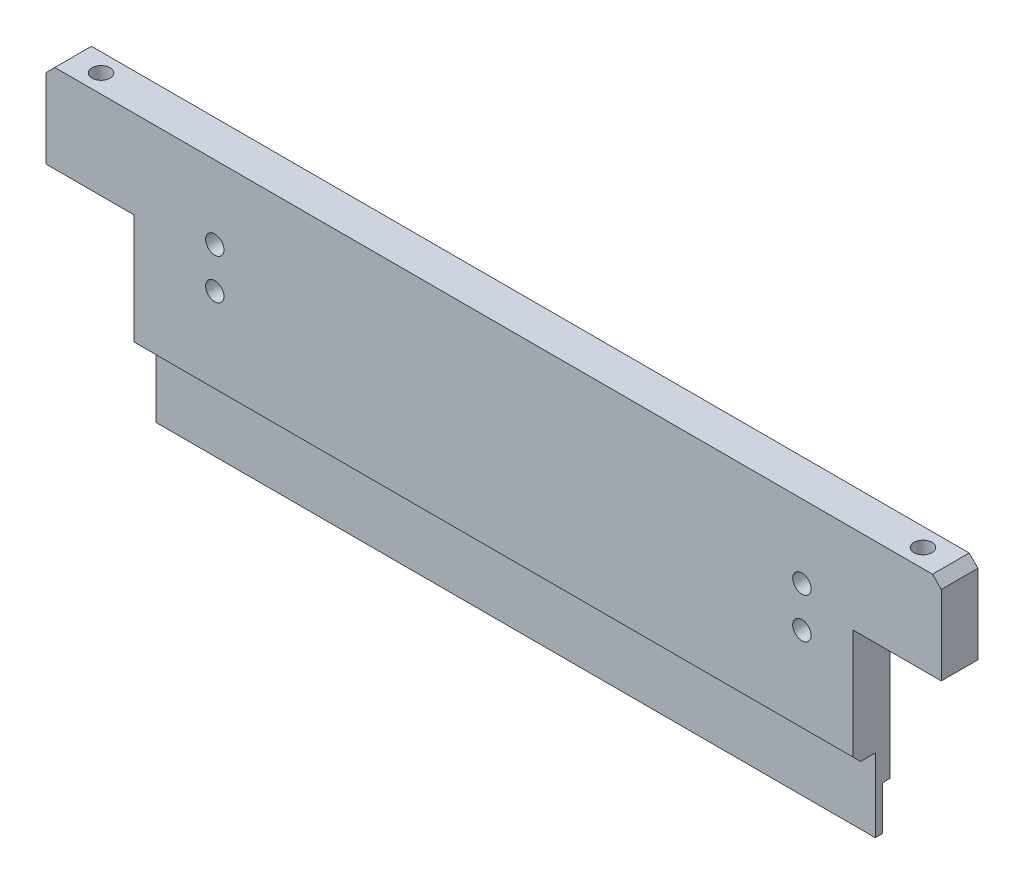
ISO-10303-21;
HEADER;
FILE_DESCRIPTION(('STEP AP214'),'2;1');
FILE_NAME('part.step','',(''),(''),'','','');
FILE_SCHEMA(('AUTOMOTIVE_DESIGN { 1 0 10303 214 1 1 1 1 }'));
ENDSEC;
DATA;
#1=APPLICATION_CONTEXT('core data for automotive mechanical design processes');
#2=APPLICATION_PROTOCOL_DEFINITION('international standard','automotive_design',2000,#1);
#3=PRODUCT_CONTEXT('',#1,'mechanical');
#4=PRODUCT('Part','Part','',(#3));
#5=PRODUCT_RELATED_PRODUCT_CATEGORY('part','',(#4));
#6=PRODUCT_DEFINITION_FORMATION('','',#4);
#7=PRODUCT_DEFINITION_CONTEXT('part definition',#1,'design');
#8=PRODUCT_DEFINITION('design','',#6,#7);
#9=PRODUCT_DEFINITION_SHAPE('','',#8);
#10=(LENGTH_UNIT() NAMED_UNIT(*) SI_UNIT(.MILLI.,.METRE.));
#11=(NAMED_UNIT(*) PLANE_ANGLE_UNIT() SI_UNIT($,.RADIAN.));
#12=(NAMED_UNIT(*) SI_UNIT($,.STERADIAN.) SOLID_ANGLE_UNIT());
#13=UNCERTAINTY_MEASURE_WITH_UNIT(LENGTH_MEASURE(1.E-05),#10,'distance_accuracy_value','');
#14=(GEOMETRIC_REPRESENTATION_CONTEXT(3) GLOBAL_UNCERTAINTY_ASSIGNED_CONTEXT((#13)) GLOBAL_UNIT_ASSIGNED_CONTEXT((#10,
#11,#12)) REPRESENTATION_CONTEXT('',''));
#15=CARTESIAN_POINT('',(0.,0.,0.));
#16=DIRECTION('',(0.,0.,1.));
#17=DIRECTION('',(1.,0.,0.));
#18=AXIS2_PLACEMENT_3D('',#15,#16,#17);
#19=CARTESIAN_POINT('',(-61.,-19.,5.));
#20=DIRECTION('',(0.,1.,0.));
#21=DIRECTION('',(0.,0.,1.));
#22=AXIS2_PLACEMENT_3D('',#19,#20,#21);
#23=PLANE('',#22);
#24=DIRECTION('',(-1.,0.,0.));
#25=VECTOR('',#24,1.);
#26=CARTESIAN_POINT('',(49.,-19.,1.));
#27=LINE('',#26,#25);
#28=CARTESIAN_POINT('',(49.,-19.,1.));
#29=VERTEX_POINT('',#28);
#30=CARTESIAN_POINT('',(-49.,-19.,1.));
#31=VERTEX_POINT('',#30);
#32=EDGE_CURVE('E146',#29,#31,#27,.T.);
#33=ORIENTED_EDGE('',*,*,#32,.F.);
#34=DIRECTION('',(0.,0.,1.));
#35=VECTOR('',#34,1.);
#36=CARTESIAN_POINT('',(49.,-19.,0.));
#37=LINE('',#36,#35);
#38=CARTESIAN_POINT('',(49.,-19.,2.));
#39=VERTEX_POINT('',#38);
#40=EDGE_CURVE('E158',#29,#39,#37,.T.);
#41=ORIENTED_EDGE('',*,*,#40,.T.);
#42=DIRECTION('',(1.,0.,0.));
#43=VECTOR('',#42,1.);
#44=CARTESIAN_POINT('',(-49.,-19.,2.));
#45=LINE('',#44,#43);
#46=CARTESIAN_POINT('',(-49.,-19.,2.));
#47=VERTEX_POINT('',#46);
#48=EDGE_CURVE('E386',#47,#39,#45,.T.);
#49=ORIENTED_EDGE('',*,*,#48,.F.);
#50=DIRECTION('',(0.,0.,1.));
#51=VECTOR('',#50,1.);
#52=CARTESIAN_POINT('',(-49.,-19.,0.));
#53=LINE('',#52,#51);
#54=EDGE_CURVE('E160',#31,#47,#53,.T.);
#55=ORIENTED_EDGE('',*,*,#54,.F.);
#56=EDGE_LOOP('',(#33,#41,#49,#55));
#57=FACE_BOUND('',#56,.T.);
#58=ADVANCED_FACE('F35',(#57),#23,.F.);
#59=CARTESIAN_POINT('',(-61.,17.8,5.));
#60=DIRECTION('',(1.,0.,0.));
#61=DIRECTION('',(0.,1.,0.));
#62=AXIS2_PLACEMENT_3D('',#59,#60,#61);
#63=PLANE('',#62);
#64=DIRECTION('',(0.,0.,1.));
#65=VECTOR('',#64,1.);
#66=CARTESIAN_POINT('',(-61.,6.99999999999999,0.));
#67=LINE('',#66,#65);
#68=CARTESIAN_POINT('',(-61.,6.99999999999999,0.));
#69=VERTEX_POINT('',#68);
#70=CARTESIAN_POINT('',(-61.,6.99999999999999,5.));
#71=VERTEX_POINT('',#70);
#72=EDGE_CURVE('E253',#69,#71,#67,.T.);
#73=ORIENTED_EDGE('',*,*,#72,.T.);
#74=DIRECTION('',(0.,-1.,0.));
#75=VECTOR('',#74,1.);
#76=CARTESIAN_POINT('',(-61.,17.8,5.));
#77=LINE('',#76,#75);
#78=CARTESIAN_POINT('',(-61.,17.8,5.));
#79=VERTEX_POINT('',#78);
#80=EDGE_CURVE('E186',#79,#71,#77,.T.);
#81=ORIENTED_EDGE('',*,*,#80,.F.);
#82=DIRECTION('',(0.,0.,-1.));
#83=VECTOR('',#82,1.);
#84=CARTESIAN_POINT('',(-61.,17.8,5.));
#85=LINE('',#84,#83);
#86=CARTESIAN_POINT('',(-61.,17.8,0.));
#87=VERTEX_POINT('',#86);
#88=EDGE_CURVE('E189',#79,#87,#85,.T.);
#89=ORIENTED_EDGE('',*,*,#88,.T.);
#90=DIRECTION('',(0.,-1.,0.));
#91=VECTOR('',#90,1.);
#92=CARTESIAN_POINT('',(-61.,17.8,0.));
#93=LINE('',#92,#91);
#94=EDGE_CURVE('E180',#87,#69,#93,.T.);
#95=ORIENTED_EDGE('',*,*,#94,.T.);
#96=EDGE_LOOP('',(#73,#81,#89,#95));
#97=FACE_BOUND('',#96,.T.);
#98=ADVANCED_FACE('F302',(#97),#63,.F.);
#99=CARTESIAN_POINT('',(0.,0.,5.));
#100=DIRECTION('',(0.,0.,1.));
#101=DIRECTION('',(1.,0.,0.));
#102=AXIS2_PLACEMENT_3D('',#99,#100,#101);
#103=PLANE('',#102);
#104=DIRECTION('',(0.,-1.,0.));
#105=VECTOR('',#104,1.);
#106=CARTESIAN_POINT('',(-49.,6.99999999999999,5.));
#107=LINE('',#106,#105);
#108=CARTESIAN_POINT('',(-49.,6.99999999999999,5.));
#109=VERTEX_POINT('',#108);
#110=CARTESIAN_POINT('',(-49.,-7.99999999999999,5.));
#111=VERTEX_POINT('',#110);
#112=EDGE_CURVE('E239',#109,#111,#107,.T.);
#113=ORIENTED_EDGE('',*,*,#112,.T.);
#114=DIRECTION('',(1.,0.,0.));
#115=VECTOR('',#114,1.);
#116=CARTESIAN_POINT('',(49.,-7.99999999999999,5.));
#117=LINE('',#116,#115);
#118=CARTESIAN_POINT('',(49.,-7.99999999999999,5.));
#119=VERTEX_POINT('',#118);
#120=EDGE_CURVE('E44',#111,#119,#117,.T.);
#121=ORIENTED_EDGE('',*,*,#120,.T.);
#122=DIRECTION('',(0.,-1.,0.));
#123=VECTOR('',#122,1.);
#124=CARTESIAN_POINT('',(49.,6.99999999999999,5.));
#125=LINE('',#124,#123);
#126=CARTESIAN_POINT('',(49.,6.99999999999999,5.));
#127=VERTEX_POINT('',#126);
#128=EDGE_CURVE('E284',#127,#119,#125,.T.);
#129=ORIENTED_EDGE('',*,*,#128,.F.);
#130=DIRECTION('',(-1.,0.,0.));
#131=VECTOR('',#130,1.);
#132=CARTESIAN_POINT('',(49.,6.99999999999999,5.));
#133=LINE('',#132,#131);
#134=CARTESIAN_POINT('',(61.,6.99999999999999,5.));
#135=VERTEX_POINT('',#134);
#136=EDGE_CURVE('E288',#135,#127,#133,.T.);
#137=ORIENTED_EDGE('',*,*,#136,.F.);
#138=DIRECTION('',(0.,1.,0.));
#139=VECTOR('',#138,1.);
#140=CARTESIAN_POINT('',(61.,17.8,5.));
#141=LINE('',#140,#139);
#142=CARTESIAN_POINT('',(61.,17.8,5.));
#143=VERTEX_POINT('',#142);
#144=EDGE_CURVE('E177',#135,#143,#141,.T.);
#145=ORIENTED_EDGE('',*,*,#144,.T.);
#146=DIRECTION('',(-0.707106781186547,0.707106781186547,0.));
#147=VECTOR('',#146,1.);
#148=CARTESIAN_POINT('',(59.8,19.,5.));
#149=LINE('',#148,#147);
#150=CARTESIAN_POINT('',(59.8,19.,5.));
#151=VERTEX_POINT('',#150);
#152=EDGE_CURVE('E179',#143,#151,#149,.T.);
#153=ORIENTED_EDGE('',*,*,#152,.T.);
#154=DIRECTION('',(-1.,0.,0.));
#155=VECTOR('',#154,1.);
#156=CARTESIAN_POINT('',(-59.8,19.,5.));
#157=LINE('',#156,#155);
#158=CARTESIAN_POINT('',(-59.8,19.,5.));
#159=VERTEX_POINT('',#158);
#160=EDGE_CURVE('E182',#151,#159,#157,.T.);
#161=ORIENTED_EDGE('',*,*,#160,.T.);
#162=DIRECTION('',(-0.707106781186547,-0.707106781186547,0.));
#163=VECTOR('',#162,1.);
#164=CARTESIAN_POINT('',(-61.,17.8,5.));
#165=LINE('',#164,#163);
#166=EDGE_CURVE('E184',#159,#79,#165,.T.);
#167=ORIENTED_EDGE('',*,*,#166,.T.);
#168=ORIENTED_EDGE('',*,*,#80,.T.);
#169=DIRECTION('',(1.,0.,0.));
#170=VECTOR('',#169,1.);
#171=CARTESIAN_POINT('',(-49.,6.99999999999999,5.));
#172=LINE('',#171,#170);
#173=EDGE_CURVE('E245',#71,#109,#172,.T.);
#174=ORIENTED_EDGE('',*,*,#173,.T.);
#175=EDGE_LOOP('',(#113,#121,#129,#137,#145,#153,#161,#167,#168,#174));
#176=FACE_BOUND('',#175,.T.);
#177=CARTESIAN_POINT('',(42.,3.5,5.));
#178=DIRECTION('',(0.,0.,1.));
#179=DIRECTION('',(1.,0.,0.));
#180=AXIS2_PLACEMENT_3D('',#177,#178,#179);
#181=CIRCLE('',#180,1.25);
#182=CARTESIAN_POINT('',(43.25,3.5,5.));
#183=VERTEX_POINT('',#182);
#184=EDGE_CURVE('E273',#183,#183,#181,.T.);
#185=ORIENTED_EDGE('',*,*,#184,.F.);
#186=EDGE_LOOP('',(#185));
#187=FACE_BOUND('',#186,.T.);
#188=CARTESIAN_POINT('',(-38.,9.,5.));
#189=DIRECTION('',(0.,0.,1.));
#190=DIRECTION('',(1.,0.,0.));
#191=AXIS2_PLACEMENT_3D('',#188,#189,#190);
#192=CIRCLE('',#191,1.25);
#193=CARTESIAN_POINT('',(-36.75,9.,5.));
#194=VERTEX_POINT('',#193);
#195=EDGE_CURVE('E266',#194,#194,#192,.T.);
#196=ORIENTED_EDGE('',*,*,#195,.F.);
#197=EDGE_LOOP('',(#196));
#198=FACE_BOUND('',#197,.T.);
#199=CARTESIAN_POINT('',(-38.,3.5,5.));
#200=DIRECTION('',(0.,0.,1.));
#201=DIRECTION('',(1.,0.,0.));
#202=AXIS2_PLACEMENT_3D('',#199,#200,#201);
#203=CIRCLE('',#202,1.25);
#204=CARTESIAN_POINT('',(-36.75,3.5,5.));
#205=VERTEX_POINT('',#204);
#206=EDGE_CURVE('E260',#205,#205,#203,.T.);
#207=ORIENTED_EDGE('',*,*,#206,.F.);
#208=EDGE_LOOP('',(#207));
#209=FACE_BOUND('',#208,.T.);
#210=CARTESIAN_POINT('',(42.,9.,5.));
#211=DIRECTION('',(0.,0.,1.));
#212=DIRECTION('',(1.,0.,0.));
#213=AXIS2_PLACEMENT_3D('',#210,#211,#212);
#214=CIRCLE('',#213,1.25);
#215=CARTESIAN_POINT('',(43.25,9.,5.));
#216=VERTEX_POINT('',#215);
#217=EDGE_CURVE('E272',#216,#216,#214,.T.);
#218=ORIENTED_EDGE('',*,*,#217,.F.);
#219=EDGE_LOOP('',(#218));
#220=FACE_BOUND('',#219,.T.);
#221=ADVANCED_FACE('F298',(#176,#187,#198,#209,#220),#103,.T.);
#222=CARTESIAN_POINT('',(0.,0.,0.));
#223=DIRECTION('',(0.,0.,1.));
#224=DIRECTION('',(1.,0.,0.));
#225=AXIS2_PLACEMENT_3D('',#222,#223,#224);
#226=PLANE('',#225);
#227=CARTESIAN_POINT('',(42.,9.,0.));
#228=DIRECTION('',(0.,0.,1.));
#229=DIRECTION('',(1.,0.,0.));
#230=AXIS2_PLACEMENT_3D('',#227,#228,#229);
#231=CIRCLE('',#230,1.25);
#232=CARTESIAN_POINT('',(43.25,9.,0.));
#233=VERTEX_POINT('',#232);
#234=EDGE_CURVE('E281',#233,#233,#231,.T.);
#235=ORIENTED_EDGE('',*,*,#234,.T.);
#236=EDGE_LOOP('',(#235));
#237=FACE_BOUND('',#236,.T.);
#238=CARTESIAN_POINT('',(-38.,3.5,0.));
#239=DIRECTION('',(0.,0.,1.));
#240=DIRECTION('',(1.,0.,0.));
#241=AXIS2_PLACEMENT_3D('',#238,#239,#240);
#242=CIRCLE('',#241,1.25);
#243=CARTESIAN_POINT('',(-36.75,3.5,0.));
#244=VERTEX_POINT('',#243);
#245=EDGE_CURVE('E263',#244,#244,#242,.T.);
#246=ORIENTED_EDGE('',*,*,#245,.T.);
#247=EDGE_LOOP('',(#246));
#248=FACE_BOUND('',#247,.T.);
#249=CARTESIAN_POINT('',(-38.,9.,0.));
#250=DIRECTION('',(0.,0.,1.));
#251=DIRECTION('',(1.,0.,0.));
#252=AXIS2_PLACEMENT_3D('',#249,#250,#251);
#253=CIRCLE('',#252,1.25);
#254=CARTESIAN_POINT('',(-36.75,9.,0.));
#255=VERTEX_POINT('',#254);
#256=EDGE_CURVE('E276',#255,#255,#253,.T.);
#257=ORIENTED_EDGE('',*,*,#256,.T.);
#258=EDGE_LOOP('',(#257));
#259=FACE_BOUND('',#258,.T.);
#260=CARTESIAN_POINT('',(42.,3.5,0.));
#261=DIRECTION('',(0.,0.,1.));
#262=DIRECTION('',(1.,0.,0.));
#263=AXIS2_PLACEMENT_3D('',#260,#261,#262);
#264=CIRCLE('',#263,1.25);
#265=CARTESIAN_POINT('',(43.25,3.5,0.));
#266=VERTEX_POINT('',#265);
#267=EDGE_CURVE('E269',#266,#266,#264,.T.);
#268=ORIENTED_EDGE('',*,*,#267,.T.);
#269=EDGE_LOOP('',(#268));
#270=FACE_BOUND('',#269,.T.);
#271=DIRECTION('',(0.,-1.,0.));
#272=VECTOR('',#271,1.);
#273=CARTESIAN_POINT('',(49.,6.99999999999999,0.));
#274=LINE('',#273,#272);
#275=CARTESIAN_POINT('',(49.,6.99999999999999,0.));
#276=VERTEX_POINT('',#275);
#277=CARTESIAN_POINT('',(49.,-13.,0.));
#278=VERTEX_POINT('',#277);
#279=EDGE_CURVE('E173',#276,#278,#274,.T.);
#280=ORIENTED_EDGE('',*,*,#279,.T.);
#281=DIRECTION('',(1.,0.,0.));
#282=VECTOR('',#281,1.);
#283=CARTESIAN_POINT('',(49.,-13.,0.));
#284=LINE('',#283,#282);
#285=CARTESIAN_POINT('',(-49.,-13.,0.));
#286=VERTEX_POINT('',#285);
#287=EDGE_CURVE('E153',#286,#278,#284,.T.);
#288=ORIENTED_EDGE('',*,*,#287,.F.);
#289=DIRECTION('',(0.,-1.,0.));
#290=VECTOR('',#289,1.);
#291=CARTESIAN_POINT('',(-49.,6.99999999999999,0.));
#292=LINE('',#291,#290);
#293=CARTESIAN_POINT('',(-49.,6.99999999999999,0.));
#294=VERTEX_POINT('',#293);
#295=EDGE_CURVE('E241',#294,#286,#292,.T.);
#296=ORIENTED_EDGE('',*,*,#295,.F.);
#297=DIRECTION('',(1.,0.,0.));
#298=VECTOR('',#297,1.);
#299=CARTESIAN_POINT('',(-49.,6.99999999999999,0.));
#300=LINE('',#299,#298);
#301=EDGE_CURVE('E244',#69,#294,#300,.T.);
#302=ORIENTED_EDGE('',*,*,#301,.F.);
#303=ORIENTED_EDGE('',*,*,#94,.F.);
#304=DIRECTION('',(-0.707106781186547,-0.707106781186547,0.));
#305=VECTOR('',#304,1.);
#306=CARTESIAN_POINT('',(-61.,17.8,0.));
#307=LINE('',#306,#305);
#308=CARTESIAN_POINT('',(-59.8,19.,0.));
#309=VERTEX_POINT('',#308);
#310=EDGE_CURVE('E196',#309,#87,#307,.T.);
#311=ORIENTED_EDGE('',*,*,#310,.F.);
#312=DIRECTION('',(-1.,0.,0.));
#313=VECTOR('',#312,1.);
#314=CARTESIAN_POINT('',(-59.8,19.,0.));
#315=LINE('',#314,#313);
#316=CARTESIAN_POINT('',(59.8,19.,0.));
#317=VERTEX_POINT('',#316);
#318=EDGE_CURVE('E194',#317,#309,#315,.T.);
#319=ORIENTED_EDGE('',*,*,#318,.F.);
#320=DIRECTION('',(-0.707106781186547,0.707106781186547,0.));
#321=VECTOR('',#320,1.);
#322=CARTESIAN_POINT('',(59.8,19.,0.));
#323=LINE('',#322,#321);
#324=CARTESIAN_POINT('',(61.,17.8,0.));
#325=VERTEX_POINT('',#324);
#326=EDGE_CURVE('E192',#325,#317,#323,.T.);
#327=ORIENTED_EDGE('',*,*,#326,.F.);
#328=DIRECTION('',(0.,1.,0.));
#329=VECTOR('',#328,1.);
#330=CARTESIAN_POINT('',(61.,17.8,0.));
#331=LINE('',#330,#329);
#332=CARTESIAN_POINT('',(61.,6.99999999999999,0.));
#333=VERTEX_POINT('',#332);
#334=EDGE_CURVE('E190',#333,#325,#331,.T.);
#335=ORIENTED_EDGE('',*,*,#334,.F.);
#336=DIRECTION('',(-1.,0.,0.));
#337=VECTOR('',#336,1.);
#338=CARTESIAN_POINT('',(49.,6.99999999999999,0.));
#339=LINE('',#338,#337);
#340=EDGE_CURVE('E168',#333,#276,#339,.T.);
#341=ORIENTED_EDGE('',*,*,#340,.T.);
#342=EDGE_LOOP('',(#280,#288,#296,#302,#303,#311,#319,#327,#335,#341));
#343=FACE_BOUND('',#342,.T.);
#344=ADVANCED_FACE('F301',(#237,#248,#259,#270,#343),#226,.F.);
#345=CARTESIAN_POINT('',(61.,17.8,5.));
#346=DIRECTION('',(-1.,0.,0.));
#347=DIRECTION('',(0.,-1.,0.));
#348=AXIS2_PLACEMENT_3D('',#345,#346,#347);
#349=PLANE('',#348);
#350=ORIENTED_EDGE('',*,*,#144,.F.);
#351=DIRECTION('',(0.,0.,1.));
#352=VECTOR('',#351,1.);
#353=CARTESIAN_POINT('',(61.,6.99999999999999,0.));
#354=LINE('',#353,#352);
#355=EDGE_CURVE('E167',#333,#135,#354,.T.);
#356=ORIENTED_EDGE('',*,*,#355,.F.);
#357=ORIENTED_EDGE('',*,*,#334,.T.);
#358=DIRECTION('',(0.,0.,-1.));
#359=VECTOR('',#358,1.);
#360=CARTESIAN_POINT('',(61.,17.8,5.));
#361=LINE('',#360,#359);
#362=EDGE_CURVE('E208',#143,#325,#361,.T.);
#363=ORIENTED_EDGE('',*,*,#362,.F.);
#364=EDGE_LOOP('',(#350,#356,#357,#363));
#365=FACE_BOUND('',#364,.T.);
#366=ADVANCED_FACE('F347',(#365),#349,.F.);
#367=CARTESIAN_POINT('',(59.8,19.,5.));
#368=DIRECTION('',(-0.707106781186548,-0.707106781186548,0.));
#369=DIRECTION('',(0.707106781186548,-0.707106781186548,0.));
#370=AXIS2_PLACEMENT_3D('',#367,#368,#369);
#371=PLANE('',#370);
#372=ORIENTED_EDGE('',*,*,#326,.T.);
#373=DIRECTION('',(0.,0.,-1.));
#374=VECTOR('',#373,1.);
#375=CARTESIAN_POINT('',(59.8,19.,5.));
#376=LINE('',#375,#374);
#377=EDGE_CURVE('E205',#151,#317,#376,.T.);
#378=ORIENTED_EDGE('',*,*,#377,.F.);
#379=ORIENTED_EDGE('',*,*,#152,.F.);
#380=ORIENTED_EDGE('',*,*,#362,.T.);
#381=EDGE_LOOP('',(#372,#378,#379,#380));
#382=FACE_BOUND('',#381,.T.);
#383=ADVANCED_FACE('F344',(#382),#371,.F.);
#384=CARTESIAN_POINT('',(-59.8,19.,5.));
#385=DIRECTION('',(0.,-1.,0.));
#386=DIRECTION('',(0.,0.,-1.));
#387=AXIS2_PLACEMENT_3D('',#384,#385,#386);
#388=PLANE('',#387);
#389=CARTESIAN_POINT('',(-56.,19.,2.5));
#390=DIRECTION('',(0.,1.,0.));
#391=DIRECTION('',(0.,0.,-1.));
#392=AXIS2_PLACEMENT_3D('',#389,#390,#391);
#393=CIRCLE('',#392,1.23);
#394=CARTESIAN_POINT('',(-56.,19.,1.27));
#395=VERTEX_POINT('',#394);
#396=EDGE_CURVE('E231',#395,#395,#393,.T.);
#397=ORIENTED_EDGE('',*,*,#396,.F.);
#398=EDGE_LOOP('',(#397));
#399=FACE_BOUND('',#398,.T.);
#400=CARTESIAN_POINT('',(56.,19.,2.5));
#401=DIRECTION('',(0.,-1.,0.));
#402=DIRECTION('',(0.,0.,-1.));
#403=AXIS2_PLACEMENT_3D('',#400,#401,#402);
#404=CIRCLE('',#403,1.23);
#405=CARTESIAN_POINT('',(56.,19.,1.27));
#406=VERTEX_POINT('',#405);
#407=EDGE_CURVE('E257',#406,#406,#404,.T.);
#408=ORIENTED_EDGE('',*,*,#407,.T.);
#409=EDGE_LOOP('',(#408));
#410=FACE_BOUND('',#409,.T.);
#411=ORIENTED_EDGE('',*,*,#318,.T.);
#412=DIRECTION('',(0.,0.,-1.));
#413=VECTOR('',#412,1.);
#414=CARTESIAN_POINT('',(-59.8,19.,5.));
#415=LINE('',#414,#413);
#416=EDGE_CURVE('E202',#159,#309,#415,.T.);
#417=ORIENTED_EDGE('',*,*,#416,.F.);
#418=ORIENTED_EDGE('',*,*,#160,.F.);
#419=ORIENTED_EDGE('',*,*,#377,.T.);
#420=EDGE_LOOP('',(#411,#417,#418,#419));
#421=FACE_BOUND('',#420,.T.);
#422=ADVANCED_FACE('F340',(#399,#410,#421),#388,.F.);
#423=CARTESIAN_POINT('',(-61.,17.8,5.));
#424=DIRECTION('',(0.707106781186548,-0.707106781186548,0.));
#425=DIRECTION('',(0.707106781186548,0.707106781186548,0.));
#426=AXIS2_PLACEMENT_3D('',#423,#424,#425);
#427=PLANE('',#426);
#428=ORIENTED_EDGE('',*,*,#310,.T.);
#429=ORIENTED_EDGE('',*,*,#88,.F.);
#430=ORIENTED_EDGE('',*,*,#166,.F.);
#431=ORIENTED_EDGE('',*,*,#416,.T.);
#432=EDGE_LOOP('',(#428,#429,#430,#431));
#433=FACE_BOUND('',#432,.T.);
#434=ADVANCED_FACE('F337',(#433),#427,.F.);
#435=CARTESIAN_POINT('',(49.,6.99999999999999,0.));
#436=DIRECTION('',(-1.,0.,0.));
#437=DIRECTION('',(0.,0.,1.));
#438=AXIS2_PLACEMENT_3D('',#435,#436,#437);
#439=PLANE('',#438);
#440=ORIENTED_EDGE('',*,*,#128,.T.);
#441=DIRECTION('',(0.,-0.707106781186548,-0.707106781186548));
#442=VECTOR('',#441,1.);
#443=CARTESIAN_POINT('',(49.,-9.00000000000001,3.99999999999999));
#444=LINE('',#443,#442);
#445=CARTESIAN_POINT('',(49.,-9.00000000000001,3.99999999999999));
#446=VERTEX_POINT('',#445);
#447=EDGE_CURVE('E11',#119,#446,#444,.T.);
#448=ORIENTED_EDGE('',*,*,#447,.T.);
#449=DIRECTION('',(0.,0.,1.));
#450=VECTOR('',#449,1.);
#451=CARTESIAN_POINT('',(49.,-9.00000000000001,2.));
#452=LINE('',#451,#450);
#453=CARTESIAN_POINT('',(49.,-9.00000000000001,2.));
#454=VERTEX_POINT('',#453);
#455=EDGE_CURVE('E222',#454,#446,#452,.T.);
#456=ORIENTED_EDGE('',*,*,#455,.F.);
#457=DIRECTION('',(0.,1.,0.));
#458=VECTOR('',#457,1.);
#459=CARTESIAN_POINT('',(49.,-9.00000000000001,2.));
#460=LINE('',#459,#458);
#461=EDGE_CURVE('E166',#39,#454,#460,.T.);
#462=ORIENTED_EDGE('',*,*,#461,.F.);
#463=ORIENTED_EDGE('',*,*,#40,.F.);
#464=DIRECTION('',(0.,-1.,0.));
#465=VECTOR('',#464,1.);
#466=CARTESIAN_POINT('',(49.,-13.,1.));
#467=LINE('',#466,#465);
#468=CARTESIAN_POINT('',(49.,-13.,1.));
#469=VERTEX_POINT('',#468);
#470=EDGE_CURVE('E143',#469,#29,#467,.T.);
#471=ORIENTED_EDGE('',*,*,#470,.F.);
#472=DIRECTION('',(0.,0.,-1.));
#473=VECTOR('',#472,1.);
#474=CARTESIAN_POINT('',(49.,-13.,1.));
#475=LINE('',#474,#473);
#476=EDGE_CURVE('E379',#469,#278,#475,.T.);
#477=ORIENTED_EDGE('',*,*,#476,.T.);
#478=ORIENTED_EDGE('',*,*,#279,.F.);
#479=DIRECTION('',(0.,0.,1.));
#480=VECTOR('',#479,1.);
#481=CARTESIAN_POINT('',(49.,6.99999999999999,0.));
#482=LINE('',#481,#480);
#483=EDGE_CURVE('E170',#276,#127,#482,.T.);
#484=ORIENTED_EDGE('',*,*,#483,.T.);
#485=EDGE_LOOP('',(#440,#448,#456,#462,#463,#471,#477,#478,#484));
#486=FACE_BOUND('',#485,.T.);
#487=ADVANCED_FACE('F164',(#486),#439,.F.);
#488=CARTESIAN_POINT('',(49.,6.99999999999999,0.));
#489=DIRECTION('',(0.,1.,0.));
#490=DIRECTION('',(0.,0.,1.));
#491=AXIS2_PLACEMENT_3D('',#488,#489,#490);
#492=PLANE('',#491);
#493=CARTESIAN_POINT('',(56.,6.99999999999999,2.5));
#494=DIRECTION('',(0.,-1.,0.));
#495=DIRECTION('',(0.,0.,-1.));
#496=AXIS2_PLACEMENT_3D('',#493,#494,#495);
#497=CIRCLE('',#496,1.23);
#498=CARTESIAN_POINT('',(56.,6.99999999999999,1.27));
#499=VERTEX_POINT('',#498);
#500=EDGE_CURVE('E252',#499,#499,#497,.T.);
#501=ORIENTED_EDGE('',*,*,#500,.F.);
#502=EDGE_LOOP('',(#501));
#503=FACE_BOUND('',#502,.T.);
#504=ORIENTED_EDGE('',*,*,#136,.T.);
#505=ORIENTED_EDGE('',*,*,#483,.F.);
#506=ORIENTED_EDGE('',*,*,#340,.F.);
#507=ORIENTED_EDGE('',*,*,#355,.T.);
#508=EDGE_LOOP('',(#504,#505,#506,#507));
#509=FACE_BOUND('',#508,.T.);
#510=ADVANCED_FACE('F295',(#503,#509),#492,.F.);
#511=CARTESIAN_POINT('',(42.,9.,0.));
#512=DIRECTION('',(0.,0.,1.));
#513=DIRECTION('',(1.,0.,0.));
#514=AXIS2_PLACEMENT_3D('',#511,#512,#513);
#515=CYLINDRICAL_SURFACE('',#514,1.25);
#516=ORIENTED_EDGE('',*,*,#234,.F.);
#517=EDGE_LOOP('',(#516));
#518=FACE_BOUND('',#517,.T.);
#519=ORIENTED_EDGE('',*,*,#217,.T.);
#520=EDGE_LOOP('',(#519));
#521=FACE_BOUND('',#520,.T.);
#522=ADVANCED_FACE('F312',(#518,#521),#515,.F.);
#523=CARTESIAN_POINT('',(-38.,3.5,0.));
#524=DIRECTION('',(0.,0.,1.));
#525=DIRECTION('',(1.,0.,0.));
#526=AXIS2_PLACEMENT_3D('',#523,#524,#525);
#527=CYLINDRICAL_SURFACE('',#526,1.25);
#528=ORIENTED_EDGE('',*,*,#245,.F.);
#529=EDGE_LOOP('',(#528));
#530=FACE_BOUND('',#529,.T.);
#531=ORIENTED_EDGE('',*,*,#206,.T.);
#532=EDGE_LOOP('',(#531));
#533=FACE_BOUND('',#532,.T.);
#534=ADVANCED_FACE('F314',(#530,#533),#527,.F.);
#535=CARTESIAN_POINT('',(-38.,9.,0.));
#536=DIRECTION('',(0.,0.,1.));
#537=DIRECTION('',(1.,0.,0.));
#538=AXIS2_PLACEMENT_3D('',#535,#536,#537);
#539=CYLINDRICAL_SURFACE('',#538,1.25);
#540=ORIENTED_EDGE('',*,*,#256,.F.);
#541=EDGE_LOOP('',(#540));
#542=FACE_BOUND('',#541,.T.);
#543=ORIENTED_EDGE('',*,*,#195,.T.);
#544=EDGE_LOOP('',(#543));
#545=FACE_BOUND('',#544,.T.);
#546=ADVANCED_FACE('F321',(#542,#545),#539,.F.);
#547=CARTESIAN_POINT('',(42.,3.5,0.));
#548=DIRECTION('',(0.,0.,1.));
#549=DIRECTION('',(1.,0.,0.));
#550=AXIS2_PLACEMENT_3D('',#547,#548,#549);
#551=CYLINDRICAL_SURFACE('',#550,1.25);
#552=ORIENTED_EDGE('',*,*,#267,.F.);
#553=EDGE_LOOP('',(#552));
#554=FACE_BOUND('',#553,.T.);
#555=ORIENTED_EDGE('',*,*,#184,.T.);
#556=EDGE_LOOP('',(#555));
#557=FACE_BOUND('',#556,.T.);
#558=ADVANCED_FACE('F415',(#554,#557),#551,.F.);
#559=CARTESIAN_POINT('',(56.,19.,2.5));
#560=DIRECTION('',(0.,-1.,0.));
#561=DIRECTION('',(0.,0.,-1.));
#562=AXIS2_PLACEMENT_3D('',#559,#560,#561);
#563=CYLINDRICAL_SURFACE('',#562,1.23);
#564=ORIENTED_EDGE('',*,*,#407,.F.);
#565=EDGE_LOOP('',(#564));
#566=FACE_BOUND('',#565,.T.);
#567=ORIENTED_EDGE('',*,*,#500,.T.);
#568=EDGE_LOOP('',(#567));
#569=FACE_BOUND('',#568,.T.);
#570=ADVANCED_FACE('F413',(#566,#569),#563,.F.);
#571=CARTESIAN_POINT('',(-49.,6.99999999999999,0.));
#572=DIRECTION('',(-1.,0.,0.));
#573=DIRECTION('',(0.,0.,1.));
#574=AXIS2_PLACEMENT_3D('',#571,#572,#573);
#575=PLANE('',#574);
#576=DIRECTION('',(0.,0.,1.));
#577=VECTOR('',#576,1.);
#578=CARTESIAN_POINT('',(-49.,-9.00000000000001,2.));
#579=LINE('',#578,#577);
#580=CARTESIAN_POINT('',(-49.,-9.00000000000001,2.));
#581=VERTEX_POINT('',#580);
#582=CARTESIAN_POINT('',(-49.,-9.00000000000001,3.99999999999999));
#583=VERTEX_POINT('',#582);
#584=EDGE_CURVE('E220',#581,#583,#579,.T.);
#585=ORIENTED_EDGE('',*,*,#584,.T.);
#586=DIRECTION('',(0.,0.707106781186548,0.707106781186548));
#587=VECTOR('',#586,1.);
#588=CARTESIAN_POINT('',(-49.,-3.,9.99999999999999));
#589=LINE('',#588,#587);
#590=EDGE_CURVE('E58',#583,#111,#589,.T.);
#591=ORIENTED_EDGE('',*,*,#590,.T.);
#592=ORIENTED_EDGE('',*,*,#112,.F.);
#593=DIRECTION('',(0.,0.,1.));
#594=VECTOR('',#593,1.);
#595=CARTESIAN_POINT('',(-49.,6.99999999999999,0.));
#596=LINE('',#595,#594);
#597=EDGE_CURVE('E247',#294,#109,#596,.T.);
#598=ORIENTED_EDGE('',*,*,#597,.F.);
#599=ORIENTED_EDGE('',*,*,#295,.T.);
#600=DIRECTION('',(0.,0.,-1.));
#601=VECTOR('',#600,1.);
#602=CARTESIAN_POINT('',(-49.,-13.,1.));
#603=LINE('',#602,#601);
#604=CARTESIAN_POINT('',(-49.,-13.,1.));
#605=VERTEX_POINT('',#604);
#606=EDGE_CURVE('E377',#605,#286,#603,.T.);
#607=ORIENTED_EDGE('',*,*,#606,.F.);
#608=DIRECTION('',(0.,1.,0.));
#609=VECTOR('',#608,1.);
#610=CARTESIAN_POINT('',(-49.,-13.,1.));
#611=LINE('',#610,#609);
#612=EDGE_CURVE('E161',#31,#605,#611,.T.);
#613=ORIENTED_EDGE('',*,*,#612,.F.);
#614=ORIENTED_EDGE('',*,*,#54,.T.);
#615=DIRECTION('',(0.,-1.,0.));
#616=VECTOR('',#615,1.);
#617=CARTESIAN_POINT('',(-49.,-9.00000000000001,2.));
#618=LINE('',#617,#616);
#619=EDGE_CURVE('E227',#581,#47,#618,.T.);
#620=ORIENTED_EDGE('',*,*,#619,.F.);
#621=EDGE_LOOP('',(#585,#591,#592,#598,#599,#607,#613,#614,#620));
#622=FACE_BOUND('',#621,.T.);
#623=ADVANCED_FACE('F225',(#622),#575,.T.);
#624=CARTESIAN_POINT('',(-49.,6.99999999999999,0.));
#625=DIRECTION('',(0.,-1.,0.));
#626=DIRECTION('',(0.,0.,-1.));
#627=AXIS2_PLACEMENT_3D('',#624,#625,#626);
#628=PLANE('',#627);
#629=CARTESIAN_POINT('',(-56.,6.99999999999999,2.5));
#630=DIRECTION('',(0.,1.,0.));
#631=DIRECTION('',(0.,0.,-1.));
#632=AXIS2_PLACEMENT_3D('',#629,#630,#631);
#633=CIRCLE('',#632,1.23);
#634=CARTESIAN_POINT('',(-56.,6.99999999999999,1.27));
#635=VERTEX_POINT('',#634);
#636=EDGE_CURVE('E228',#635,#635,#633,.T.);
#637=ORIENTED_EDGE('',*,*,#636,.T.);
#638=EDGE_LOOP('',(#637));
#639=FACE_BOUND('',#638,.T.);
#640=ORIENTED_EDGE('',*,*,#173,.F.);
#641=ORIENTED_EDGE('',*,*,#72,.F.);
#642=ORIENTED_EDGE('',*,*,#301,.T.);
#643=ORIENTED_EDGE('',*,*,#597,.T.);
#644=EDGE_LOOP('',(#640,#641,#642,#643));
#645=FACE_BOUND('',#644,.T.);
#646=ADVANCED_FACE('F371',(#639,#645),#628,.T.);
#647=CARTESIAN_POINT('',(-56.,19.,2.5));
#648=DIRECTION('',(0.,-1.,0.));
#649=DIRECTION('',(0.,0.,-1.));
#650=AXIS2_PLACEMENT_3D('',#647,#648,#649);
#651=CYLINDRICAL_SURFACE('',#650,1.23);
#652=ORIENTED_EDGE('',*,*,#396,.T.);
#653=EDGE_LOOP('',(#652));
#654=FACE_BOUND('',#653,.T.);
#655=ORIENTED_EDGE('',*,*,#636,.F.);
#656=EDGE_LOOP('',(#655));
#657=FACE_BOUND('',#656,.T.);
#658=ADVANCED_FACE('F404',(#654,#657),#651,.F.);
#659=CARTESIAN_POINT('',(-49.,-9.00000000000001,2.));
#660=DIRECTION('',(0.,1.,0.));
#661=DIRECTION('',(0.,0.,1.));
#662=AXIS2_PLACEMENT_3D('',#659,#660,#661);
#663=PLANE('',#662);
#664=ORIENTED_EDGE('',*,*,#455,.T.);
#665=DIRECTION('',(-1.,0.,0.));
#666=VECTOR('',#665,1.);
#667=CARTESIAN_POINT('',(-49.,-9.00000000000001,3.99999999999999));
#668=LINE('',#667,#666);
#669=EDGE_CURVE('E211',#446,#583,#668,.T.);
#670=ORIENTED_EDGE('',*,*,#669,.T.);
#671=ORIENTED_EDGE('',*,*,#584,.F.);
#672=DIRECTION('',(-1.,0.,0.));
#673=VECTOR('',#672,1.);
#674=CARTESIAN_POINT('',(-49.,-9.00000000000001,2.));
#675=LINE('',#674,#673);
#676=EDGE_CURVE('E233',#454,#581,#675,.T.);
#677=ORIENTED_EDGE('',*,*,#676,.F.);
#678=EDGE_LOOP('',(#664,#670,#671,#677));
#679=FACE_BOUND('',#678,.T.);
#680=ADVANCED_FACE('F218',(#679),#663,.F.);
#681=CARTESIAN_POINT('',(0.,0.,2.));
#682=DIRECTION('',(0.,0.,1.));
#683=DIRECTION('',(1.,0.,0.));
#684=AXIS2_PLACEMENT_3D('',#681,#682,#683);
#685=PLANE('',#684);
#686=ORIENTED_EDGE('',*,*,#619,.T.);
#687=ORIENTED_EDGE('',*,*,#48,.T.);
#688=ORIENTED_EDGE('',*,*,#461,.T.);
#689=ORIENTED_EDGE('',*,*,#676,.T.);
#690=EDGE_LOOP('',(#686,#687,#688,#689));
#691=FACE_BOUND('',#690,.T.);
#692=ADVANCED_FACE('F388',(#691),#685,.T.);
#693=CARTESIAN_POINT('',(49.,-13.,1.));
#694=DIRECTION('',(0.,1.,0.));
#695=DIRECTION('',(0.,0.,1.));
#696=AXIS2_PLACEMENT_3D('',#693,#694,#695);
#697=PLANE('',#696);
#698=ORIENTED_EDGE('',*,*,#287,.T.);
#699=ORIENTED_EDGE('',*,*,#476,.F.);
#700=DIRECTION('',(1.,0.,0.));
#701=VECTOR('',#700,1.);
#702=CARTESIAN_POINT('',(49.,-13.,1.));
#703=LINE('',#702,#701);
#704=EDGE_CURVE('E149',#605,#469,#703,.T.);
#705=ORIENTED_EDGE('',*,*,#704,.F.);
#706=ORIENTED_EDGE('',*,*,#606,.T.);
#707=EDGE_LOOP('',(#698,#699,#705,#706));
#708=FACE_BOUND('',#707,.T.);
#709=ADVANCED_FACE('F393',(#708),#697,.F.);
#710=CARTESIAN_POINT('',(0.,0.,1.));
#711=DIRECTION('',(0.,0.,-1.));
#712=DIRECTION('',(-1.,0.,0.));
#713=AXIS2_PLACEMENT_3D('',#710,#711,#712);
#714=PLANE('',#713);
#715=ORIENTED_EDGE('',*,*,#470,.T.);
#716=ORIENTED_EDGE('',*,*,#32,.T.);
#717=ORIENTED_EDGE('',*,*,#612,.T.);
#718=ORIENTED_EDGE('',*,*,#704,.T.);
#719=EDGE_LOOP('',(#715,#716,#717,#718));
#720=FACE_BOUND('',#719,.T.);
#721=ADVANCED_FACE('F145',(#720),#714,.T.);
#722=CARTESIAN_POINT('',(-49.,-9.00000000000001,3.99999999999999));
#723=DIRECTION('',(0.,-0.707106781186547,0.707106781186547));
#724=DIRECTION('',(1.,0.,0.));
#725=AXIS2_PLACEMENT_3D('',#722,#723,#724);
#726=PLANE('',#725);
#727=ORIENTED_EDGE('',*,*,#447,.F.);
#728=ORIENTED_EDGE('',*,*,#120,.F.);
#729=ORIENTED_EDGE('',*,*,#590,.F.);
#730=ORIENTED_EDGE('',*,*,#669,.F.);
#731=EDGE_LOOP('',(#727,#728,#729,#730));
#732=FACE_BOUND('',#731,.T.);
#733=ADVANCED_FACE('F38',(#732),#726,.T.);
#734=CLOSED_SHELL('',(#58,#98,#221,#344,#366,#383,#422,#434,#487,#510,#522,#534,#546,#558,#570,
#623,#646,#658,#680,#692,#709,#721,#733));
#735=MANIFOLD_SOLID_BREP('B2',#734);
#736=ADVANCED_BREP_SHAPE_REPRESENTATION('',(#18,#735),#14);
#737=SHAPE_DEFINITION_REPRESENTATION(#9,#736);
ENDSEC;
END-ISO-10303-21;
